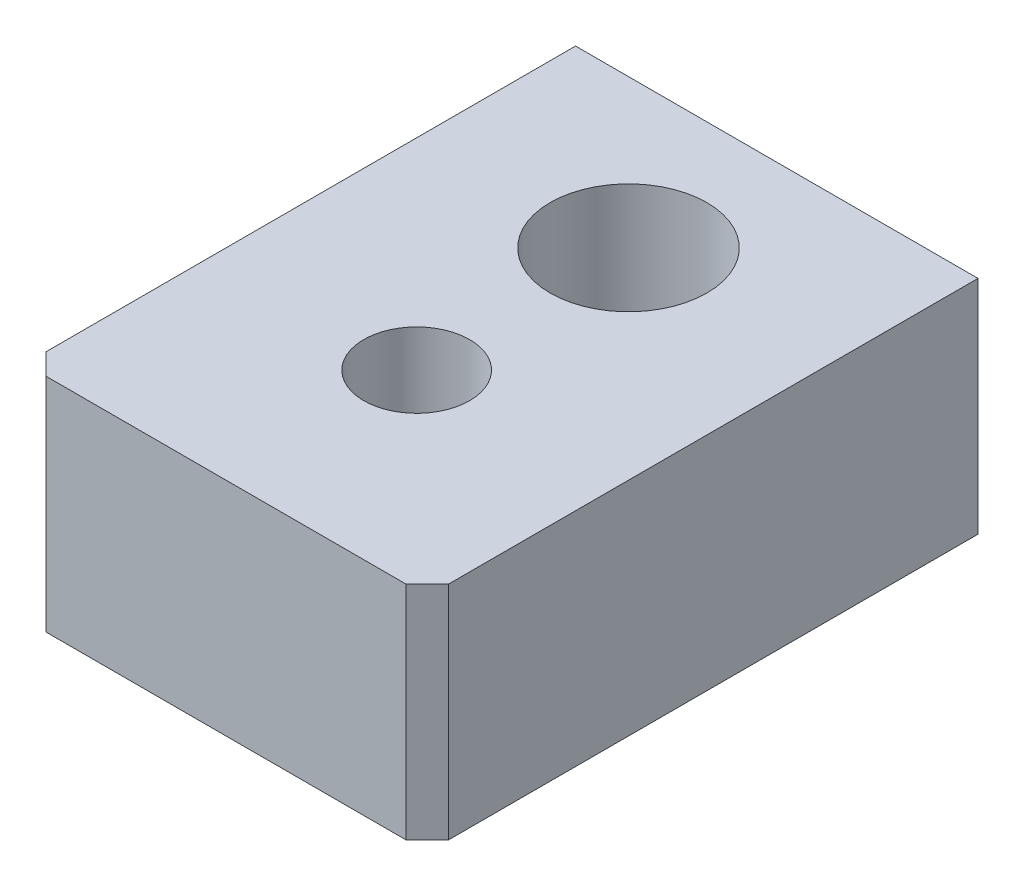
ISO-10303-21;
HEADER;
FILE_DESCRIPTION(('STEP AP214'),'2;1');
FILE_NAME('part.step','',(''),(''),'','','');
FILE_SCHEMA(('AUTOMOTIVE_DESIGN { 1 0 10303 214 1 1 1 1 }'));
ENDSEC;
DATA;
#1=APPLICATION_CONTEXT('core data for automotive mechanical design processes');
#2=APPLICATION_PROTOCOL_DEFINITION('international standard','automotive_design',2000,#1);
#3=PRODUCT_CONTEXT('',#1,'mechanical');
#4=PRODUCT('Part','Part','',(#3));
#5=PRODUCT_RELATED_PRODUCT_CATEGORY('part','',(#4));
#6=PRODUCT_DEFINITION_FORMATION('','',#4);
#7=PRODUCT_DEFINITION_CONTEXT('part definition',#1,'design');
#8=PRODUCT_DEFINITION('design','',#6,#7);
#9=PRODUCT_DEFINITION_SHAPE('','',#8);
#10=(LENGTH_UNIT() NAMED_UNIT(*) SI_UNIT(.MILLI.,.METRE.));
#11=(NAMED_UNIT(*) PLANE_ANGLE_UNIT() SI_UNIT($,.RADIAN.));
#12=(NAMED_UNIT(*) SI_UNIT($,.STERADIAN.) SOLID_ANGLE_UNIT());
#13=UNCERTAINTY_MEASURE_WITH_UNIT(LENGTH_MEASURE(1.E-05),#10,'distance_accuracy_value','');
#14=(GEOMETRIC_REPRESENTATION_CONTEXT(3) GLOBAL_UNCERTAINTY_ASSIGNED_CONTEXT((#13)) GLOBAL_UNIT_ASSIGNED_CONTEXT((#10,
#11,#12)) REPRESENTATION_CONTEXT('',''));
#15=CARTESIAN_POINT('',(0.,0.,0.));
#16=DIRECTION('',(0.,0.,1.));
#17=DIRECTION('',(1.,0.,0.));
#18=AXIS2_PLACEMENT_3D('',#15,#16,#17);
#19=CARTESIAN_POINT('',(2.75,3.12,5.));
#20=DIRECTION('',(-1.,0.,0.));
#21=DIRECTION('',(0.,-1.,0.));
#22=AXIS2_PLACEMENT_3D('',#19,#20,#21);
#23=PLANE('',#22);
#24=DIRECTION('',(0.,0.,-1.));
#25=VECTOR('',#24,1.);
#26=CARTESIAN_POINT('',(2.75,-2.11,5.));
#27=LINE('',#26,#25);
#28=CARTESIAN_POINT('',(2.75,-2.11,5.));
#29=VERTEX_POINT('',#28);
#30=CARTESIAN_POINT('',(2.75,-2.11,-5.));
#31=VERTEX_POINT('',#30);
#32=EDGE_CURVE('E141',#29,#31,#27,.T.);
#33=ORIENTED_EDGE('',*,*,#32,.F.);
#34=DIRECTION('',(0.,1.,0.));
#35=VECTOR('',#34,1.);
#36=CARTESIAN_POINT('',(2.75,3.12,5.));
#37=LINE('',#36,#35);
#38=CARTESIAN_POINT('',(2.75,-3.12,5.));
#39=VERTEX_POINT('',#38);
#40=EDGE_CURVE('E150',#39,#29,#37,.T.);
#41=ORIENTED_EDGE('',*,*,#40,.F.);
#42=DIRECTION('',(0.,0.,-1.));
#43=VECTOR('',#42,1.);
#44=CARTESIAN_POINT('',(2.75,-3.12,5.));
#45=LINE('',#44,#43);
#46=CARTESIAN_POINT('',(2.75,-3.12,-5.));
#47=VERTEX_POINT('',#46);
#48=EDGE_CURVE('E165',#39,#47,#45,.T.);
#49=ORIENTED_EDGE('',*,*,#48,.T.);
#50=DIRECTION('',(0.,1.,0.));
#51=VECTOR('',#50,1.);
#52=CARTESIAN_POINT('',(2.75,3.12,-5.));
#53=LINE('',#52,#51);
#54=EDGE_CURVE('E159',#47,#31,#53,.T.);
#55=ORIENTED_EDGE('',*,*,#54,.T.);
#56=EDGE_LOOP('',(#33,#41,#49,#55));
#57=FACE_BOUND('',#56,.T.);
#58=ADVANCED_FACE('F30',(#57),#23,.F.);
#59=CARTESIAN_POINT('',(-2.75,-3.12,5.));
#60=DIRECTION('',(1.,0.,0.));
#61=DIRECTION('',(0.,0.,-1.));
#62=AXIS2_PLACEMENT_3D('',#59,#60,#61);
#63=PLANE('',#62);
#64=DIRECTION('',(0.,0.,1.));
#65=VECTOR('',#64,1.);
#66=CARTESIAN_POINT('',(-2.75,-2.11,5.));
#67=LINE('',#66,#65);
#68=CARTESIAN_POINT('',(-2.75,-2.11,-5.));
#69=VERTEX_POINT('',#68);
#70=CARTESIAN_POINT('',(-2.75,-2.11,5.));
#71=VERTEX_POINT('',#70);
#72=EDGE_CURVE('E138',#69,#71,#67,.T.);
#73=ORIENTED_EDGE('',*,*,#72,.F.);
#74=DIRECTION('',(0.,-1.,0.));
#75=VECTOR('',#74,1.);
#76=CARTESIAN_POINT('',(-2.75,-3.12,-5.));
#77=LINE('',#76,#75);
#78=CARTESIAN_POINT('',(-2.75,-3.12,-5.));
#79=VERTEX_POINT('',#78);
#80=EDGE_CURVE('E151',#69,#79,#77,.T.);
#81=ORIENTED_EDGE('',*,*,#80,.T.);
#82=DIRECTION('',(0.,0.,-1.));
#83=VECTOR('',#82,1.);
#84=CARTESIAN_POINT('',(-2.75,-3.12,5.));
#85=LINE('',#84,#83);
#86=CARTESIAN_POINT('',(-2.75,-3.12,5.));
#87=VERTEX_POINT('',#86);
#88=EDGE_CURVE('E156',#87,#79,#85,.T.);
#89=ORIENTED_EDGE('',*,*,#88,.F.);
#90=DIRECTION('',(0.,-1.,0.));
#91=VECTOR('',#90,1.);
#92=CARTESIAN_POINT('',(-2.75,-3.12,5.));
#93=LINE('',#92,#91);
#94=EDGE_CURVE('E154',#71,#87,#93,.T.);
#95=ORIENTED_EDGE('',*,*,#94,.F.);
#96=EDGE_LOOP('',(#73,#81,#89,#95));
#97=FACE_BOUND('',#96,.T.);
#98=ADVANCED_FACE('F207',(#97),#63,.F.);
#99=CARTESIAN_POINT('',(2.75,-3.12,5.));
#100=DIRECTION('',(0.,0.,1.));
#101=DIRECTION('',(1.,0.,0.));
#102=AXIS2_PLACEMENT_3D('',#99,#100,#101);
#103=PLANE('',#102);
#104=ORIENTED_EDGE('',*,*,#40,.T.);
#105=DIRECTION('',(-1.,0.,0.));
#106=VECTOR('',#105,1.);
#107=CARTESIAN_POINT('',(2.75,-2.11,5.));
#108=LINE('',#107,#106);
#109=EDGE_CURVE('E144',#29,#71,#108,.T.);
#110=ORIENTED_EDGE('',*,*,#109,.T.);
#111=ORIENTED_EDGE('',*,*,#94,.T.);
#112=DIRECTION('',(1.,0.,0.));
#113=VECTOR('',#112,1.);
#114=CARTESIAN_POINT('',(2.75,-3.12,5.));
#115=LINE('',#114,#113);
#116=EDGE_CURVE('E147',#87,#39,#115,.T.);
#117=ORIENTED_EDGE('',*,*,#116,.T.);
#118=EDGE_LOOP('',(#104,#110,#111,#117));
#119=FACE_BOUND('',#118,.T.);
#120=ADVANCED_FACE('F213',(#119),#103,.T.);
#121=CARTESIAN_POINT('',(2.75,-3.12,-5.));
#122=DIRECTION('',(0.,0.,1.));
#123=DIRECTION('',(1.,0.,0.));
#124=AXIS2_PLACEMENT_3D('',#121,#122,#123);
#125=PLANE('',#124);
#126=DIRECTION('',(-1.,0.,0.));
#127=VECTOR('',#126,1.);
#128=CARTESIAN_POINT('',(2.75,-2.11,-5.));
#129=LINE('',#128,#127);
#130=EDGE_CURVE('E168',#31,#69,#129,.T.);
#131=ORIENTED_EDGE('',*,*,#130,.F.);
#132=ORIENTED_EDGE('',*,*,#54,.F.);
#133=DIRECTION('',(1.,0.,0.));
#134=VECTOR('',#133,1.);
#135=CARTESIAN_POINT('',(2.75,-3.12,-5.));
#136=LINE('',#135,#134);
#137=EDGE_CURVE('E146',#79,#47,#136,.T.);
#138=ORIENTED_EDGE('',*,*,#137,.F.);
#139=ORIENTED_EDGE('',*,*,#80,.F.);
#140=EDGE_LOOP('',(#131,#132,#138,#139));
#141=FACE_BOUND('',#140,.T.);
#142=ADVANCED_FACE('F219',(#141),#125,.F.);
#143=CARTESIAN_POINT('',(2.75,-3.12,5.));
#144=DIRECTION('',(0.,1.,0.));
#145=DIRECTION('',(-1.,0.,0.));
#146=AXIS2_PLACEMENT_3D('',#143,#144,#145);
#147=PLANE('',#146);
#148=CARTESIAN_POINT('',(0.,-3.12,2.5));
#149=DIRECTION('',(0.,-1.,0.));
#150=DIRECTION('',(1.,0.,0.));
#151=AXIS2_PLACEMENT_3D('',#148,#149,#150);
#152=CIRCLE('',#151,1.25);
#153=CARTESIAN_POINT('',(1.25,-3.12,2.5));
#154=VERTEX_POINT('',#153);
#155=EDGE_CURVE('E231',#154,#154,#152,.T.);
#156=ORIENTED_EDGE('',*,*,#155,.F.);
#157=EDGE_LOOP('',(#156));
#158=FACE_BOUND('',#157,.T.);
#159=CARTESIAN_POINT('',(0.,-3.12,-2.5));
#160=DIRECTION('',(0.,-1.,0.));
#161=DIRECTION('',(0.,0.,-1.));
#162=AXIS2_PLACEMENT_3D('',#159,#160,#161);
#163=CIRCLE('',#162,1.85);
#164=CARTESIAN_POINT('',(0.,-3.12,-4.35));
#165=VERTEX_POINT('',#164);
#166=EDGE_CURVE('E126',#165,#165,#163,.T.);
#167=ORIENTED_EDGE('',*,*,#166,.F.);
#168=EDGE_LOOP('',(#167));
#169=FACE_BOUND('',#168,.T.);
#170=ORIENTED_EDGE('',*,*,#137,.T.);
#171=ORIENTED_EDGE('',*,*,#48,.F.);
#172=ORIENTED_EDGE('',*,*,#116,.F.);
#173=ORIENTED_EDGE('',*,*,#88,.T.);
#174=EDGE_LOOP('',(#170,#171,#172,#173));
#175=FACE_BOUND('',#174,.T.);
#176=ADVANCED_FACE('F217',(#158,#169,#175),#147,.F.);
#177=CARTESIAN_POINT('',(4.75,-2.11,7.));
#178=DIRECTION('',(1.,0.,0.));
#179=DIRECTION('',(0.,0.,-1.));
#180=AXIS2_PLACEMENT_3D('',#177,#178,#179);
#181=PLANE('',#180);
#182=DIRECTION('',(0.,-1.,0.));
#183=VECTOR('',#182,1.);
#184=CARTESIAN_POINT('',(4.75,3.12,-6.));
#185=LINE('',#184,#183);
#186=CARTESIAN_POINT('',(4.75,3.12,-6.));
#187=VERTEX_POINT('',#186);
#188=CARTESIAN_POINT('',(4.75,-2.11,-6.));
#189=VERTEX_POINT('',#188);
#190=EDGE_CURVE('E107',#187,#189,#185,.T.);
#191=ORIENTED_EDGE('',*,*,#190,.F.);
#192=DIRECTION('',(0.,0.,-1.));
#193=VECTOR('',#192,1.);
#194=CARTESIAN_POINT('',(4.75,3.12,7.));
#195=LINE('',#194,#193);
#196=CARTESIAN_POINT('',(4.75,3.12,6.5));
#197=VERTEX_POINT('',#196);
#198=EDGE_CURVE('E117',#197,#187,#195,.T.);
#199=ORIENTED_EDGE('',*,*,#198,.F.);
#200=DIRECTION('',(0.,-1.,0.));
#201=VECTOR('',#200,1.);
#202=CARTESIAN_POINT('',(4.75,-2.11,6.5));
#203=LINE('',#202,#201);
#204=CARTESIAN_POINT('',(4.75,-2.11,6.5));
#205=VERTEX_POINT('',#204);
#206=EDGE_CURVE('E179',#197,#205,#203,.T.);
#207=ORIENTED_EDGE('',*,*,#206,.T.);
#208=DIRECTION('',(0.,0.,-1.));
#209=VECTOR('',#208,1.);
#210=CARTESIAN_POINT('',(4.75,-2.11,7.));
#211=LINE('',#210,#209);
#212=EDGE_CURVE('E120',#205,#189,#211,.T.);
#213=ORIENTED_EDGE('',*,*,#212,.T.);
#214=EDGE_LOOP('',(#191,#199,#207,#213));
#215=FACE_BOUND('',#214,.T.);
#216=ADVANCED_FACE('F116',(#215),#181,.T.);
#217=CARTESIAN_POINT('',(-4.75,-2.11,7.));
#218=DIRECTION('',(0.,0.,1.));
#219=DIRECTION('',(1.,0.,0.));
#220=AXIS2_PLACEMENT_3D('',#217,#218,#219);
#221=PLANE('',#220);
#222=DIRECTION('',(1.,0.,0.));
#223=VECTOR('',#222,1.);
#224=CARTESIAN_POINT('',(-4.75,-2.11,7.));
#225=LINE('',#224,#223);
#226=CARTESIAN_POINT('',(-4.25,-2.11,7.));
#227=VERTEX_POINT('',#226);
#228=CARTESIAN_POINT('',(4.25,-2.11,7.));
#229=VERTEX_POINT('',#228);
#230=EDGE_CURVE('E134',#227,#229,#225,.T.);
#231=ORIENTED_EDGE('',*,*,#230,.T.);
#232=DIRECTION('',(0.,1.,0.));
#233=VECTOR('',#232,1.);
#234=CARTESIAN_POINT('',(4.25,-2.11,7.));
#235=LINE('',#234,#233);
#236=CARTESIAN_POINT('',(4.25,3.12,7.));
#237=VERTEX_POINT('',#236);
#238=EDGE_CURVE('E173',#229,#237,#235,.T.);
#239=ORIENTED_EDGE('',*,*,#238,.T.);
#240=DIRECTION('',(1.,0.,0.));
#241=VECTOR('',#240,1.);
#242=CARTESIAN_POINT('',(-4.75,3.12,7.));
#243=LINE('',#242,#241);
#244=CARTESIAN_POINT('',(-4.25,3.12,7.));
#245=VERTEX_POINT('',#244);
#246=EDGE_CURVE('E128',#245,#237,#243,.T.);
#247=ORIENTED_EDGE('',*,*,#246,.F.);
#248=DIRECTION('',(0.,-1.,0.));
#249=VECTOR('',#248,1.);
#250=CARTESIAN_POINT('',(-4.25,-2.11,7.));
#251=LINE('',#250,#249);
#252=EDGE_CURVE('E171',#245,#227,#251,.T.);
#253=ORIENTED_EDGE('',*,*,#252,.T.);
#254=EDGE_LOOP('',(#231,#239,#247,#253));
#255=FACE_BOUND('',#254,.T.);
#256=ADVANCED_FACE('F191',(#255),#221,.T.);
#257=CARTESIAN_POINT('',(-4.75,-2.11,-7.));
#258=DIRECTION('',(-1.,0.,0.));
#259=DIRECTION('',(0.,0.,1.));
#260=AXIS2_PLACEMENT_3D('',#257,#258,#259);
#261=PLANE('',#260);
#262=DIRECTION('',(0.,-1.,0.));
#263=VECTOR('',#262,1.);
#264=CARTESIAN_POINT('',(-4.75,3.12,-6.));
#265=LINE('',#264,#263);
#266=CARTESIAN_POINT('',(-4.75,3.12,-6.));
#267=VERTEX_POINT('',#266);
#268=CARTESIAN_POINT('',(-4.75,-2.11,-6.));
#269=VERTEX_POINT('',#268);
#270=EDGE_CURVE('E45',#267,#269,#265,.T.);
#271=ORIENTED_EDGE('',*,*,#270,.T.);
#272=DIRECTION('',(0.,0.,1.));
#273=VECTOR('',#272,1.);
#274=CARTESIAN_POINT('',(-4.75,-2.11,-7.));
#275=LINE('',#274,#273);
#276=CARTESIAN_POINT('',(-4.75,-2.11,6.49999999999999));
#277=VERTEX_POINT('',#276);
#278=EDGE_CURVE('E51',#269,#277,#275,.T.);
#279=ORIENTED_EDGE('',*,*,#278,.T.);
#280=DIRECTION('',(0.,1.,0.));
#281=VECTOR('',#280,1.);
#282=CARTESIAN_POINT('',(-4.75,-2.11,6.5));
#283=LINE('',#282,#281);
#284=CARTESIAN_POINT('',(-4.75,3.12,6.49999999999999));
#285=VERTEX_POINT('',#284);
#286=EDGE_CURVE('E11',#277,#285,#283,.T.);
#287=ORIENTED_EDGE('',*,*,#286,.T.);
#288=DIRECTION('',(0.,0.,1.));
#289=VECTOR('',#288,1.);
#290=CARTESIAN_POINT('',(-4.75,3.12,-7.));
#291=LINE('',#290,#289);
#292=EDGE_CURVE('E125',#267,#285,#291,.T.);
#293=ORIENTED_EDGE('',*,*,#292,.F.);
#294=EDGE_LOOP('',(#271,#279,#287,#293));
#295=FACE_BOUND('',#294,.T.);
#296=ADVANCED_FACE('F244',(#295),#261,.T.);
#297=CARTESIAN_POINT('',(4.75,-2.11,-7.));
#298=DIRECTION('',(0.,1.,0.));
#299=DIRECTION('',(0.,0.,1.));
#300=AXIS2_PLACEMENT_3D('',#297,#298,#299);
#301=PLANE('',#300);
#302=ORIENTED_EDGE('',*,*,#109,.F.);
#303=ORIENTED_EDGE('',*,*,#32,.T.);
#304=ORIENTED_EDGE('',*,*,#130,.T.);
#305=ORIENTED_EDGE('',*,*,#72,.T.);
#306=EDGE_LOOP('',(#302,#303,#304,#305));
#307=FACE_BOUND('',#306,.T.);
#308=ORIENTED_EDGE('',*,*,#278,.F.);
#309=DIRECTION('',(1.,0.,0.));
#310=VECTOR('',#309,1.);
#311=CARTESIAN_POINT('',(4.75,-2.11,-6.));
#312=LINE('',#311,#310);
#313=EDGE_CURVE('E356',#269,#189,#312,.T.);
#314=ORIENTED_EDGE('',*,*,#313,.T.);
#315=ORIENTED_EDGE('',*,*,#212,.F.);
#316=DIRECTION('',(0.707106781186548,0.,-0.707106781186548));
#317=VECTOR('',#316,1.);
#318=CARTESIAN_POINT('',(4.25,-2.11,7.));
#319=LINE('',#318,#317);
#320=EDGE_CURVE('E38',#205,#229,#319,.F.);
#321=ORIENTED_EDGE('',*,*,#320,.T.);
#322=ORIENTED_EDGE('',*,*,#230,.F.);
#323=DIRECTION('',(0.707106781186549,0.,0.707106781186546));
#324=VECTOR('',#323,1.);
#325=CARTESIAN_POINT('',(-4.75,-2.11,6.5));
#326=LINE('',#325,#324);
#327=EDGE_CURVE('E181',#227,#277,#326,.F.);
#328=ORIENTED_EDGE('',*,*,#327,.T.);
#329=EDGE_LOOP('',(#308,#314,#315,#321,#322,#328));
#330=FACE_BOUND('',#329,.T.);
#331=ADVANCED_FACE('F186',(#307,#330),#301,.F.);
#332=CARTESIAN_POINT('',(-2.75,3.12,5.));
#333=DIRECTION('',(0.,-1.,0.));
#334=DIRECTION('',(0.,0.,-1.));
#335=AXIS2_PLACEMENT_3D('',#332,#333,#334);
#336=PLANE('',#335);
#337=CARTESIAN_POINT('',(0.,3.12,2.5));
#338=DIRECTION('',(0.,-1.,0.));
#339=DIRECTION('',(1.,0.,0.));
#340=AXIS2_PLACEMENT_3D('',#337,#338,#339);
#341=CIRCLE('',#340,1.25);
#342=CARTESIAN_POINT('',(1.25,3.12,2.5));
#343=VERTEX_POINT('',#342);
#344=EDGE_CURVE('E350',#343,#343,#341,.T.);
#345=ORIENTED_EDGE('',*,*,#344,.T.);
#346=EDGE_LOOP('',(#345));
#347=FACE_BOUND('',#346,.T.);
#348=CARTESIAN_POINT('',(0.,3.12,-2.5));
#349=DIRECTION('',(0.,-1.,0.));
#350=DIRECTION('',(0.,0.,-1.));
#351=AXIS2_PLACEMENT_3D('',#348,#349,#350);
#352=CIRCLE('',#351,1.85);
#353=CARTESIAN_POINT('',(0.,3.12,-4.35));
#354=VERTEX_POINT('',#353);
#355=EDGE_CURVE('E131',#354,#354,#352,.T.);
#356=ORIENTED_EDGE('',*,*,#355,.T.);
#357=EDGE_LOOP('',(#356));
#358=FACE_BOUND('',#357,.T.);
#359=ORIENTED_EDGE('',*,*,#198,.T.);
#360=DIRECTION('',(-1.,0.,0.));
#361=VECTOR('',#360,1.);
#362=CARTESIAN_POINT('',(-4.75,3.12,-6.));
#363=LINE('',#362,#361);
#364=EDGE_CURVE('E104',#187,#267,#363,.T.);
#365=ORIENTED_EDGE('',*,*,#364,.T.);
#366=ORIENTED_EDGE('',*,*,#292,.T.);
#367=DIRECTION('',(-0.707106781186549,0.,-0.707106781186546));
#368=VECTOR('',#367,1.);
#369=CARTESIAN_POINT('',(-4.75,3.12,6.5));
#370=LINE('',#369,#368);
#371=EDGE_CURVE('E176',#285,#245,#370,.F.);
#372=ORIENTED_EDGE('',*,*,#371,.T.);
#373=ORIENTED_EDGE('',*,*,#246,.T.);
#374=DIRECTION('',(-0.707106781186548,0.,0.707106781186548));
#375=VECTOR('',#374,1.);
#376=CARTESIAN_POINT('',(4.25,3.12,7.));
#377=LINE('',#376,#375);
#378=EDGE_CURVE('E124',#237,#197,#377,.F.);
#379=ORIENTED_EDGE('',*,*,#378,.T.);
#380=EDGE_LOOP('',(#359,#365,#366,#372,#373,#379));
#381=FACE_BOUND('',#380,.T.);
#382=ADVANCED_FACE('F122',(#347,#358,#381),#336,.F.);
#383=CARTESIAN_POINT('',(0.,-3.12,-2.5));
#384=DIRECTION('',(0.,-1.,0.));
#385=DIRECTION('',(0.,0.,-1.));
#386=AXIS2_PLACEMENT_3D('',#383,#384,#385);
#387=CYLINDRICAL_SURFACE('',#386,1.85);
#388=ORIENTED_EDGE('',*,*,#355,.F.);
#389=EDGE_LOOP('',(#388));
#390=FACE_BOUND('',#389,.T.);
#391=ORIENTED_EDGE('',*,*,#166,.T.);
#392=EDGE_LOOP('',(#391));
#393=FACE_BOUND('',#392,.T.);
#394=ADVANCED_FACE('F202',(#390,#393),#387,.F.);
#395=CARTESIAN_POINT('',(0.,3.12,2.5));
#396=DIRECTION('',(0.,-1.,0.));
#397=DIRECTION('',(1.,0.,0.));
#398=AXIS2_PLACEMENT_3D('',#395,#396,#397);
#399=CYLINDRICAL_SURFACE('',#398,1.25);
#400=ORIENTED_EDGE('',*,*,#344,.F.);
#401=EDGE_LOOP('',(#400));
#402=FACE_BOUND('',#401,.T.);
#403=ORIENTED_EDGE('',*,*,#155,.T.);
#404=EDGE_LOOP('',(#403));
#405=FACE_BOUND('',#404,.T.);
#406=ADVANCED_FACE('F196',(#402,#405),#399,.F.);
#407=CARTESIAN_POINT('',(4.25,-2.11,7.));
#408=DIRECTION('',(-0.707106781186548,0.,-0.707106781186548));
#409=DIRECTION('',(-0.707106781186548,0.,0.707106781186548));
#410=AXIS2_PLACEMENT_3D('',#407,#408,#409);
#411=PLANE('',#410);
#412=ORIENTED_EDGE('',*,*,#320,.F.);
#413=ORIENTED_EDGE('',*,*,#206,.F.);
#414=ORIENTED_EDGE('',*,*,#378,.F.);
#415=ORIENTED_EDGE('',*,*,#238,.F.);
#416=EDGE_LOOP('',(#412,#413,#414,#415));
#417=FACE_BOUND('',#416,.T.);
#418=ADVANCED_FACE('F194',(#417),#411,.F.);
#419=CARTESIAN_POINT('',(-4.75,-2.11,6.5));
#420=DIRECTION('',(0.707106781186546,0.,-0.707106781186549));
#421=DIRECTION('',(-0.707106781186549,0.,-0.707106781186546));
#422=AXIS2_PLACEMENT_3D('',#419,#420,#421);
#423=PLANE('',#422);
#424=ORIENTED_EDGE('',*,*,#327,.F.);
#425=ORIENTED_EDGE('',*,*,#252,.F.);
#426=ORIENTED_EDGE('',*,*,#371,.F.);
#427=ORIENTED_EDGE('',*,*,#286,.F.);
#428=EDGE_LOOP('',(#424,#425,#426,#427));
#429=FACE_BOUND('',#428,.T.);
#430=ADVANCED_FACE('F32',(#429),#423,.F.);
#431=CARTESIAN_POINT('',(-4.75,3.12,-6.));
#432=DIRECTION('',(0.,0.,1.));
#433=DIRECTION('',(1.,0.,0.));
#434=AXIS2_PLACEMENT_3D('',#431,#432,#433);
#435=PLANE('',#434);
#436=ORIENTED_EDGE('',*,*,#270,.F.);
#437=ORIENTED_EDGE('',*,*,#364,.F.);
#438=ORIENTED_EDGE('',*,*,#190,.T.);
#439=ORIENTED_EDGE('',*,*,#313,.F.);
#440=EDGE_LOOP('',(#436,#437,#438,#439));
#441=FACE_BOUND('',#440,.T.);
#442=ADVANCED_FACE('F106',(#441),#435,.F.);
#443=CLOSED_SHELL('',(#58,#98,#120,#142,#176,#216,#256,#296,#331,#382,#394,#406,#418,#430,#442));
#444=MANIFOLD_SOLID_BREP('B2',#443);
#445=ADVANCED_BREP_SHAPE_REPRESENTATION('',(#18,#444),#14);
#446=SHAPE_DEFINITION_REPRESENTATION(#9,#445);
ENDSEC;
END-ISO-10303-21;
